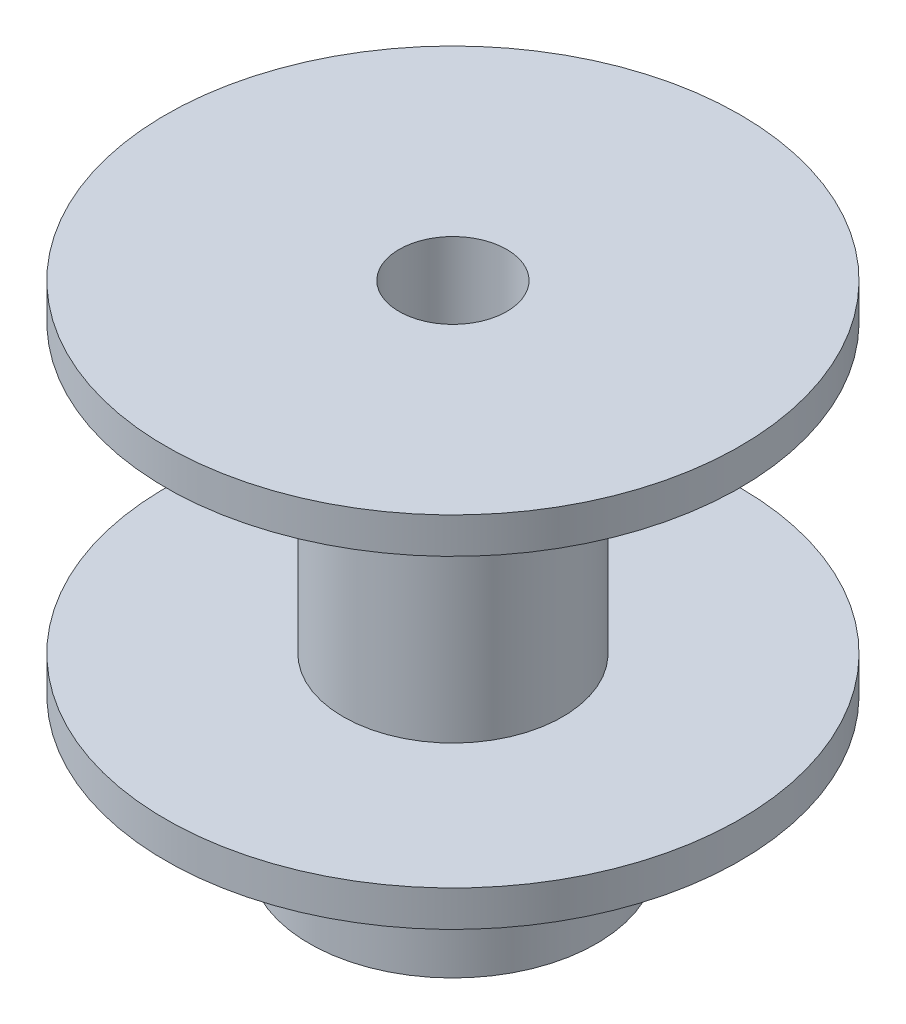
ISO-10303-21;
HEADER;
FILE_DESCRIPTION(('STEP AP214'),'2;1');
FILE_NAME('part.step','',(''),(''),'','','');
FILE_SCHEMA(('AUTOMOTIVE_DESIGN { 1 0 10303 214 1 1 1 1 }'));
ENDSEC;
DATA;
#1=APPLICATION_CONTEXT('core data for automotive mechanical design processes');
#2=APPLICATION_PROTOCOL_DEFINITION('international standard','automotive_design',2000,#1);
#3=PRODUCT_CONTEXT('',#1,'mechanical');
#4=PRODUCT('Part','Part','',(#3));
#5=PRODUCT_RELATED_PRODUCT_CATEGORY('part','',(#4));
#6=PRODUCT_DEFINITION_FORMATION('','',#4);
#7=PRODUCT_DEFINITION_CONTEXT('part definition',#1,'design');
#8=PRODUCT_DEFINITION('design','',#6,#7);
#9=PRODUCT_DEFINITION_SHAPE('','',#8);
#10=(LENGTH_UNIT() NAMED_UNIT(*) SI_UNIT(.MILLI.,.METRE.));
#11=(NAMED_UNIT(*) PLANE_ANGLE_UNIT() SI_UNIT($,.RADIAN.));
#12=(NAMED_UNIT(*) SI_UNIT($,.STERADIAN.) SOLID_ANGLE_UNIT());
#13=UNCERTAINTY_MEASURE_WITH_UNIT(LENGTH_MEASURE(1.E-05),#10,'distance_accuracy_value','');
#14=(GEOMETRIC_REPRESENTATION_CONTEXT(3) GLOBAL_UNCERTAINTY_ASSIGNED_CONTEXT((#13)) GLOBAL_UNIT_ASSIGNED_CONTEXT((#10,
#11,#12)) REPRESENTATION_CONTEXT('',''));
#15=CARTESIAN_POINT('',(0.,0.,0.));
#16=DIRECTION('',(0.,0.,1.));
#17=DIRECTION('',(1.,0.,0.));
#18=AXIS2_PLACEMENT_3D('',#15,#16,#17);
#19=CARTESIAN_POINT('',(0.,-8.97640405699462,0.));
#20=DIRECTION('',(0.,-1.,0.));
#21=DIRECTION('',(0.,0.,-1.));
#22=AXIS2_PLACEMENT_3D('',#19,#20,#21);
#23=CYLINDRICAL_SURFACE('',#22,12.7);
#24=CARTESIAN_POINT('',(0.,14.2875,0.));
#25=DIRECTION('',(0.,-1.,0.));
#26=DIRECTION('',(0.,0.,-1.));
#27=AXIS2_PLACEMENT_3D('',#24,#25,#26);
#28=CIRCLE('',#27,12.7);
#29=CARTESIAN_POINT('',(0.,14.2875,-12.7));
#30=VERTEX_POINT('',#29);
#31=EDGE_CURVE('E10',#30,#30,#28,.T.);
#32=ORIENTED_EDGE('',*,*,#31,.F.);
#33=EDGE_LOOP('',(#32));
#34=FACE_BOUND('',#33,.T.);
#35=CARTESIAN_POINT('',(0.,15.875,0.));
#36=DIRECTION('',(0.,-1.,0.));
#37=DIRECTION('',(0.,0.,-1.));
#38=AXIS2_PLACEMENT_3D('',#35,#36,#37);
#39=CIRCLE('',#38,12.7);
#40=CARTESIAN_POINT('',(0.,15.875,-12.7));
#41=VERTEX_POINT('',#40);
#42=EDGE_CURVE('E62',#41,#41,#39,.T.);
#43=ORIENTED_EDGE('',*,*,#42,.T.);
#44=EDGE_LOOP('',(#43));
#45=FACE_BOUND('',#44,.T.);
#46=ADVANCED_FACE('F28',(#34,#45),#23,.T.);
#47=CARTESIAN_POINT('',(-12.7,14.2875,0.));
#48=DIRECTION('',(0.,1.,0.));
#49=DIRECTION('',(0.,0.,1.));
#50=AXIS2_PLACEMENT_3D('',#47,#48,#49);
#51=PLANE('',#50);
#52=CARTESIAN_POINT('',(0.,14.2875,0.));
#53=DIRECTION('',(0.,-1.,0.));
#54=DIRECTION('',(0.,0.,-1.));
#55=AXIS2_PLACEMENT_3D('',#52,#53,#54);
#56=CIRCLE('',#55,4.8514);
#57=CARTESIAN_POINT('',(0.,14.2875,-4.8514));
#58=VERTEX_POINT('',#57);
#59=EDGE_CURVE('E34',#58,#58,#56,.T.);
#60=ORIENTED_EDGE('',*,*,#59,.F.);
#61=EDGE_LOOP('',(#60));
#62=FACE_BOUND('',#61,.T.);
#63=ORIENTED_EDGE('',*,*,#31,.T.);
#64=EDGE_LOOP('',(#63));
#65=FACE_BOUND('',#64,.T.);
#66=ADVANCED_FACE('F111',(#62,#65),#51,.F.);
#67=CARTESIAN_POINT('',(0.,-8.97640405699462,0.));
#68=DIRECTION('',(0.,-1.,0.));
#69=DIRECTION('',(0.,0.,-1.));
#70=AXIS2_PLACEMENT_3D('',#67,#68,#69);
#71=CYLINDRICAL_SURFACE('',#70,4.8514);
#72=CARTESIAN_POINT('',(0.,1.5875,0.));
#73=DIRECTION('',(0.,-1.,0.));
#74=DIRECTION('',(0.,0.,-1.));
#75=AXIS2_PLACEMENT_3D('',#72,#73,#74);
#76=CIRCLE('',#75,4.8514);
#77=CARTESIAN_POINT('',(0.,1.5875,-4.8514));
#78=VERTEX_POINT('',#77);
#79=EDGE_CURVE('E38',#78,#78,#76,.T.);
#80=ORIENTED_EDGE('',*,*,#79,.F.);
#81=EDGE_LOOP('',(#80));
#82=FACE_BOUND('',#81,.T.);
#83=ORIENTED_EDGE('',*,*,#59,.T.);
#84=EDGE_LOOP('',(#83));
#85=FACE_BOUND('',#84,.T.);
#86=ADVANCED_FACE('F106',(#82,#85),#71,.T.);
#87=CARTESIAN_POINT('',(-4.8514,1.5875,0.));
#88=DIRECTION('',(0.,-1.,0.));
#89=DIRECTION('',(0.,0.,-1.));
#90=AXIS2_PLACEMENT_3D('',#87,#88,#89);
#91=PLANE('',#90);
#92=CARTESIAN_POINT('',(0.,1.5875,0.));
#93=DIRECTION('',(0.,-1.,0.));
#94=DIRECTION('',(0.,0.,-1.));
#95=AXIS2_PLACEMENT_3D('',#92,#93,#94);
#96=CIRCLE('',#95,12.7);
#97=CARTESIAN_POINT('',(0.,1.5875,-12.7));
#98=VERTEX_POINT('',#97);
#99=EDGE_CURVE('E42',#98,#98,#96,.T.);
#100=ORIENTED_EDGE('',*,*,#99,.F.);
#101=EDGE_LOOP('',(#100));
#102=FACE_BOUND('',#101,.T.);
#103=ORIENTED_EDGE('',*,*,#79,.T.);
#104=EDGE_LOOP('',(#103));
#105=FACE_BOUND('',#104,.T.);
#106=ADVANCED_FACE('F100',(#102,#105),#91,.F.);
#107=CARTESIAN_POINT('',(0.,-8.97640405699462,0.));
#108=DIRECTION('',(0.,-1.,0.));
#109=DIRECTION('',(0.,0.,-1.));
#110=AXIS2_PLACEMENT_3D('',#107,#108,#109);
#111=CYLINDRICAL_SURFACE('',#110,12.7);
#112=CARTESIAN_POINT('',(0.,0.,0.));
#113=DIRECTION('',(0.,-1.,0.));
#114=DIRECTION('',(0.,0.,-1.));
#115=AXIS2_PLACEMENT_3D('',#112,#113,#114);
#116=CIRCLE('',#115,12.7);
#117=CARTESIAN_POINT('',(0.,0.,-12.7));
#118=VERTEX_POINT('',#117);
#119=EDGE_CURVE('E47',#118,#118,#116,.T.);
#120=ORIENTED_EDGE('',*,*,#119,.F.);
#121=EDGE_LOOP('',(#120));
#122=FACE_BOUND('',#121,.T.);
#123=ORIENTED_EDGE('',*,*,#99,.T.);
#124=EDGE_LOOP('',(#123));
#125=FACE_BOUND('',#124,.T.);
#126=ADVANCED_FACE('F94',(#122,#125),#111,.T.);
#127=CARTESIAN_POINT('',(-12.7,0.,0.));
#128=DIRECTION('',(0.,1.,0.));
#129=DIRECTION('',(0.,0.,1.));
#130=AXIS2_PLACEMENT_3D('',#127,#128,#129);
#131=PLANE('',#130);
#132=CARTESIAN_POINT('',(0.,0.,0.));
#133=DIRECTION('',(0.,-1.,0.));
#134=DIRECTION('',(0.,0.,-1.));
#135=AXIS2_PLACEMENT_3D('',#132,#133,#134);
#136=CIRCLE('',#135,6.35);
#137=CARTESIAN_POINT('',(0.,0.,-6.35));
#138=VERTEX_POINT('',#137);
#139=EDGE_CURVE('E50',#138,#138,#136,.T.);
#140=ORIENTED_EDGE('',*,*,#139,.F.);
#141=EDGE_LOOP('',(#140));
#142=FACE_BOUND('',#141,.T.);
#143=ORIENTED_EDGE('',*,*,#119,.T.);
#144=EDGE_LOOP('',(#143));
#145=FACE_BOUND('',#144,.T.);
#146=ADVANCED_FACE('F88',(#142,#145),#131,.F.);
#147=CARTESIAN_POINT('',(0.,-8.97640405699462,0.));
#148=DIRECTION('',(0.,-1.,0.));
#149=DIRECTION('',(0.,0.,-1.));
#150=AXIS2_PLACEMENT_3D('',#147,#148,#149);
#151=CYLINDRICAL_SURFACE('',#150,6.35);
#152=CARTESIAN_POINT('',(0.,-6.35,0.));
#153=DIRECTION('',(0.,-1.,0.));
#154=DIRECTION('',(0.,0.,-1.));
#155=AXIS2_PLACEMENT_3D('',#152,#153,#154);
#156=CIRCLE('',#155,6.35);
#157=CARTESIAN_POINT('',(0.,-6.35,-6.35));
#158=VERTEX_POINT('',#157);
#159=EDGE_CURVE('E53',#158,#158,#156,.T.);
#160=ORIENTED_EDGE('',*,*,#159,.F.);
#161=EDGE_LOOP('',(#160));
#162=FACE_BOUND('',#161,.T.);
#163=ORIENTED_EDGE('',*,*,#139,.T.);
#164=EDGE_LOOP('',(#163));
#165=FACE_BOUND('',#164,.T.);
#166=ADVANCED_FACE('F82',(#162,#165),#151,.T.);
#167=CARTESIAN_POINT('',(-6.35,-6.35,0.));
#168=DIRECTION('',(0.,1.,0.));
#169=DIRECTION('',(0.,0.,1.));
#170=AXIS2_PLACEMENT_3D('',#167,#168,#169);
#171=PLANE('',#170);
#172=CARTESIAN_POINT('',(0.,-6.35,0.));
#173=DIRECTION('',(0.,-1.,0.));
#174=DIRECTION('',(0.,0.,-1.));
#175=AXIS2_PLACEMENT_3D('',#172,#173,#174);
#176=CIRCLE('',#175,2.38125);
#177=CARTESIAN_POINT('',(0.,-6.35,-2.38125));
#178=VERTEX_POINT('',#177);
#179=EDGE_CURVE('E56',#178,#178,#176,.T.);
#180=ORIENTED_EDGE('',*,*,#179,.F.);
#181=EDGE_LOOP('',(#180));
#182=FACE_BOUND('',#181,.T.);
#183=ORIENTED_EDGE('',*,*,#159,.T.);
#184=EDGE_LOOP('',(#183));
#185=FACE_BOUND('',#184,.T.);
#186=ADVANCED_FACE('F76',(#182,#185),#171,.F.);
#187=CARTESIAN_POINT('',(0.,-8.97640405699462,0.));
#188=DIRECTION('',(0.,-1.,0.));
#189=DIRECTION('',(0.,0.,-1.));
#190=AXIS2_PLACEMENT_3D('',#187,#188,#189);
#191=CYLINDRICAL_SURFACE('',#190,2.38125);
#192=CARTESIAN_POINT('',(0.,15.875,0.));
#193=DIRECTION('',(0.,-1.,0.));
#194=DIRECTION('',(0.,0.,-1.));
#195=AXIS2_PLACEMENT_3D('',#192,#193,#194);
#196=CIRCLE('',#195,2.38125);
#197=CARTESIAN_POINT('',(0.,15.875,-2.38125));
#198=VERTEX_POINT('',#197);
#199=EDGE_CURVE('E59',#198,#198,#196,.T.);
#200=ORIENTED_EDGE('',*,*,#199,.F.);
#201=EDGE_LOOP('',(#200));
#202=FACE_BOUND('',#201,.T.);
#203=ORIENTED_EDGE('',*,*,#179,.T.);
#204=EDGE_LOOP('',(#203));
#205=FACE_BOUND('',#204,.T.);
#206=ADVANCED_FACE('F70',(#202,#205),#191,.F.);
#207=CARTESIAN_POINT('',(-2.38125,15.875,0.));
#208=DIRECTION('',(0.,-1.,0.));
#209=DIRECTION('',(0.,0.,-1.));
#210=AXIS2_PLACEMENT_3D('',#207,#208,#209);
#211=PLANE('',#210);
#212=ORIENTED_EDGE('',*,*,#42,.F.);
#213=EDGE_LOOP('',(#212));
#214=FACE_BOUND('',#213,.T.);
#215=ORIENTED_EDGE('',*,*,#199,.T.);
#216=EDGE_LOOP('',(#215));
#217=FACE_BOUND('',#216,.T.);
#218=ADVANCED_FACE('F67',(#214,#217),#211,.F.);
#219=CLOSED_SHELL('',(#46,#66,#86,#106,#126,#146,#166,#186,#206,#218));
#220=MANIFOLD_SOLID_BREP('B2',#219);
#221=ADVANCED_BREP_SHAPE_REPRESENTATION('',(#18,#220),#14);
#222=SHAPE_DEFINITION_REPRESENTATION(#9,#221);
ENDSEC;
END-ISO-10303-21;
